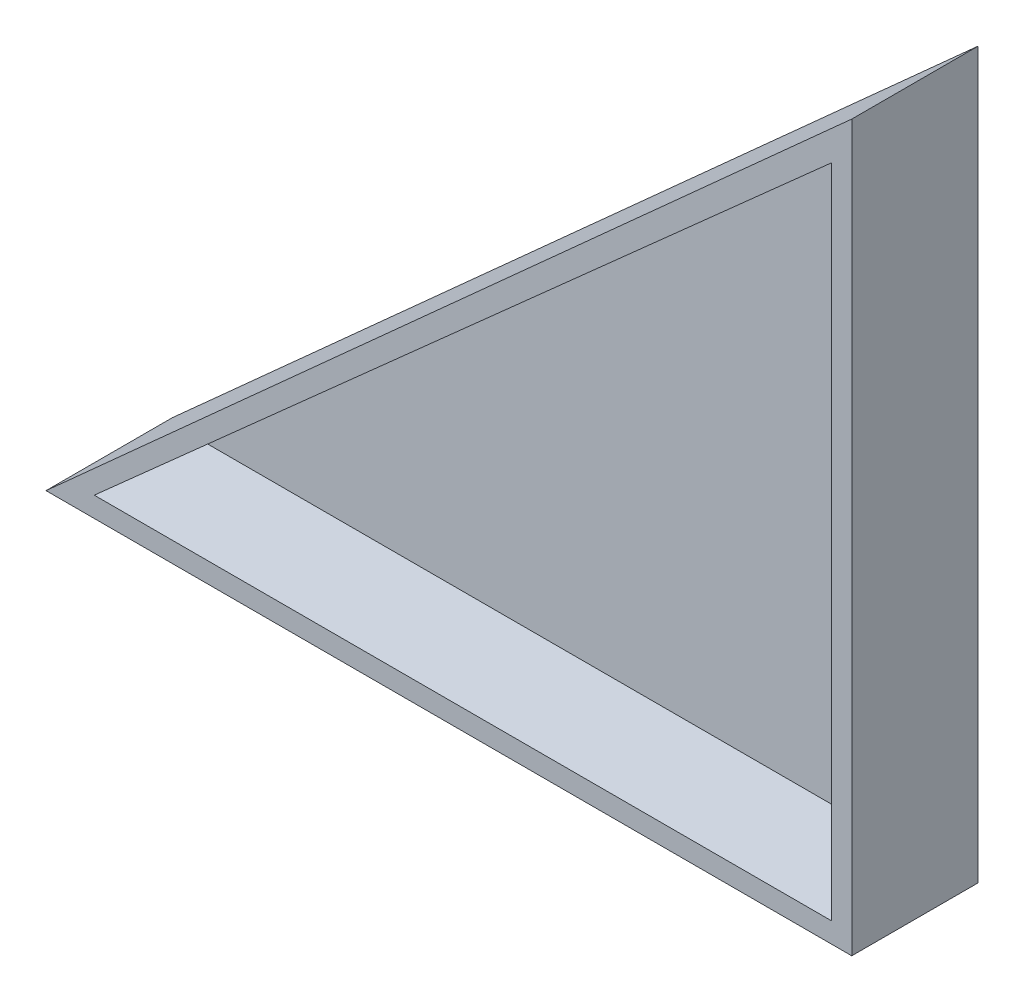
ISO-10303-21;
HEADER;
FILE_DESCRIPTION(('STEP AP214'),'2;1');
FILE_NAME('part.step','',(''),(''),'','','');
FILE_SCHEMA(('AUTOMOTIVE_DESIGN { 1 0 10303 214 1 1 1 1 }'));
ENDSEC;
DATA;
#1=APPLICATION_CONTEXT('core data for automotive mechanical design processes');
#2=APPLICATION_PROTOCOL_DEFINITION('international standard','automotive_design',2000,#1);
#3=PRODUCT_CONTEXT('',#1,'mechanical');
#4=PRODUCT('Part','Part','',(#3));
#5=PRODUCT_RELATED_PRODUCT_CATEGORY('part','',(#4));
#6=PRODUCT_DEFINITION_FORMATION('','',#4);
#7=PRODUCT_DEFINITION_CONTEXT('part definition',#1,'design');
#8=PRODUCT_DEFINITION('design','',#6,#7);
#9=PRODUCT_DEFINITION_SHAPE('','',#8);
#10=(LENGTH_UNIT() NAMED_UNIT(*) SI_UNIT(.MILLI.,.METRE.));
#11=(NAMED_UNIT(*) PLANE_ANGLE_UNIT() SI_UNIT($,.RADIAN.));
#12=(NAMED_UNIT(*) SI_UNIT($,.STERADIAN.) SOLID_ANGLE_UNIT());
#13=UNCERTAINTY_MEASURE_WITH_UNIT(LENGTH_MEASURE(1.E-05),#10,'distance_accuracy_value','');
#14=(GEOMETRIC_REPRESENTATION_CONTEXT(3) GLOBAL_UNCERTAINTY_ASSIGNED_CONTEXT((#13)) GLOBAL_UNIT_ASSIGNED_CONTEXT((#10,
#11,#12)) REPRESENTATION_CONTEXT('',''));
#15=CARTESIAN_POINT('',(0.,0.,0.));
#16=DIRECTION('',(0.,0.,1.));
#17=DIRECTION('',(1.,0.,0.));
#18=AXIS2_PLACEMENT_3D('',#15,#16,#17);
#19=CARTESIAN_POINT('',(0.,0.,1.5875));
#20=DIRECTION('',(0.,0.,-1.));
#21=DIRECTION('',(-1.,0.,0.));
#22=AXIS2_PLACEMENT_3D('',#19,#20,#21);
#23=PLANE('',#22);
#24=DIRECTION('',(0.,-1.,0.));
#25=VECTOR('',#24,1.);
#26=CARTESIAN_POINT('',(33.2174473505233,54.3486887095964,1.5875));
#27=LINE('',#26,#25);
#28=CARTESIAN_POINT('',(33.2174473505233,54.3486887095964,1.5875));
#29=VERTEX_POINT('',#28);
#30=CARTESIAN_POINT('',(33.2174473505233,13.0736887095964,1.5875));
#31=VERTEX_POINT('',#30);
#32=EDGE_CURVE('E54',#29,#31,#27,.T.);
#33=ORIENTED_EDGE('',*,*,#32,.F.);
#34=DIRECTION('',(-0.746844593870614,-0.664998610980683,0.));
#35=VECTOR('',#34,1.);
#36=CARTESIAN_POINT('',(33.2174473505233,54.3486887095964,1.5875));
#37=LINE('',#36,#35);
#38=CARTESIAN_POINT('',(-13.1375526494767,13.0736887095963,1.5875));
#39=VERTEX_POINT('',#38);
#40=EDGE_CURVE('E11',#29,#39,#37,.T.);
#41=ORIENTED_EDGE('',*,*,#40,.T.);
#42=DIRECTION('',(-1.,0.,0.));
#43=VECTOR('',#42,1.);
#44=CARTESIAN_POINT('',(33.2174473505233,13.0736887095964,1.5875));
#45=LINE('',#44,#43);
#46=EDGE_CURVE('E48',#31,#39,#45,.T.);
#47=ORIENTED_EDGE('',*,*,#46,.F.);
#48=EDGE_LOOP('',(#33,#41,#47));
#49=FACE_BOUND('',#48,.T.);
#50=ADVANCED_FACE('F39',(#49),#23,.F.);
#51=CARTESIAN_POINT('',(33.2174473505233,54.3486887095964,7.9375));
#52=DIRECTION('',(0.664998610980683,-0.746844593870614,0.));
#53=DIRECTION('',(0.746844593870614,0.664998610980683,0.));
#54=AXIS2_PLACEMENT_3D('',#51,#52,#53);
#55=PLANE('',#54);
#56=ORIENTED_EDGE('',*,*,#40,.F.);
#57=DIRECTION('',(0.,0.,-1.));
#58=VECTOR('',#57,1.);
#59=CARTESIAN_POINT('',(33.2174473505233,54.3486887095964,7.9375));
#60=LINE('',#59,#58);
#61=CARTESIAN_POINT('',(33.2174473505233,54.3486887095964,7.9375));
#62=VERTEX_POINT('',#61);
#63=EDGE_CURVE('E95',#62,#29,#60,.T.);
#64=ORIENTED_EDGE('',*,*,#63,.F.);
#65=DIRECTION('',(-0.746844593870614,-0.664998610980683,0.));
#66=VECTOR('',#65,1.);
#67=CARTESIAN_POINT('',(33.2174473505233,54.3486887095964,7.9375));
#68=LINE('',#67,#66);
#69=CARTESIAN_POINT('',(-13.1375526494767,13.0736887095963,7.9375));
#70=VERTEX_POINT('',#69);
#71=EDGE_CURVE('E90',#62,#70,#68,.T.);
#72=ORIENTED_EDGE('',*,*,#71,.T.);
#73=DIRECTION('',(0.,0.,-1.));
#74=VECTOR('',#73,1.);
#75=CARTESIAN_POINT('',(-13.1375526494767,13.0736887095963,7.9375));
#76=LINE('',#75,#74);
#77=EDGE_CURVE('E93',#70,#39,#76,.T.);
#78=ORIENTED_EDGE('',*,*,#77,.T.);
#79=EDGE_LOOP('',(#56,#64,#72,#78));
#80=FACE_BOUND('',#79,.T.);
#81=ADVANCED_FACE('F92',(#80),#55,.T.);
#82=CARTESIAN_POINT('',(33.2174473505233,13.0736887095964,7.9375));
#83=DIRECTION('',(0.,1.,0.));
#84=DIRECTION('',(-1.,0.,0.));
#85=AXIS2_PLACEMENT_3D('',#82,#83,#84);
#86=PLANE('',#85);
#87=ORIENTED_EDGE('',*,*,#46,.T.);
#88=ORIENTED_EDGE('',*,*,#77,.F.);
#89=DIRECTION('',(1.,0.,0.));
#90=VECTOR('',#89,1.);
#91=CARTESIAN_POINT('',(33.2174473505233,13.0736887095964,7.9375));
#92=LINE('',#91,#90);
#93=CARTESIAN_POINT('',(33.2174473505233,13.0736887095964,7.9375));
#94=VERTEX_POINT('',#93);
#95=EDGE_CURVE('E100',#70,#94,#92,.T.);
#96=ORIENTED_EDGE('',*,*,#95,.T.);
#97=DIRECTION('',(0.,0.,-1.));
#98=VECTOR('',#97,1.);
#99=CARTESIAN_POINT('',(33.2174473505233,13.0736887095964,7.9375));
#100=LINE('',#99,#98);
#101=EDGE_CURVE('E108',#94,#31,#100,.T.);
#102=ORIENTED_EDGE('',*,*,#101,.T.);
#103=EDGE_LOOP('',(#87,#88,#96,#102));
#104=FACE_BOUND('',#103,.T.);
#105=ADVANCED_FACE('F104',(#104),#86,.T.);
#106=CARTESIAN_POINT('',(33.2174473505233,54.3486887095964,7.9375));
#107=DIRECTION('',(-1.,0.,0.));
#108=DIRECTION('',(0.,-1.,0.));
#109=AXIS2_PLACEMENT_3D('',#106,#107,#108);
#110=PLANE('',#109);
#111=ORIENTED_EDGE('',*,*,#32,.T.);
#112=ORIENTED_EDGE('',*,*,#101,.F.);
#113=DIRECTION('',(0.,1.,0.));
#114=VECTOR('',#113,1.);
#115=CARTESIAN_POINT('',(33.2174473505233,54.3486887095964,7.9375));
#116=LINE('',#115,#114);
#117=EDGE_CURVE('E111',#94,#62,#116,.T.);
#118=ORIENTED_EDGE('',*,*,#117,.T.);
#119=ORIENTED_EDGE('',*,*,#63,.T.);
#120=EDGE_LOOP('',(#111,#112,#118,#119));
#121=FACE_BOUND('',#120,.T.);
#122=ADVANCED_FACE('F155',(#121),#110,.T.);
#123=CARTESIAN_POINT('',(0.,0.,7.9375));
#124=DIRECTION('',(0.,0.,1.));
#125=DIRECTION('',(1.,0.,0.));
#126=AXIS2_PLACEMENT_3D('',#123,#124,#125);
#127=PLANE('',#126);
#128=DIRECTION('',(-0.743529626144011,-0.66870299464422,0.));
#129=VECTOR('',#128,1.);
#130=CARTESIAN_POINT('',(34.4874473505233,57.3647466855964,7.9375));
#131=LINE('',#130,#129);
#132=CARTESIAN_POINT('',(34.4874473505233,57.3647466855964,7.9375));
#133=VERTEX_POINT('',#132);
#134=CARTESIAN_POINT('',(-16.1718089634766,11.8036887095963,7.9375));
#135=VERTEX_POINT('',#134);
#136=EDGE_CURVE('E121',#133,#135,#131,.T.);
#137=ORIENTED_EDGE('',*,*,#136,.T.);
#138=DIRECTION('',(1.,0.,0.));
#139=VECTOR('',#138,1.);
#140=CARTESIAN_POINT('',(34.4874473505234,11.8036887095964,7.9375));
#141=LINE('',#140,#139);
#142=CARTESIAN_POINT('',(34.4874473505234,11.8036887095964,7.9375));
#143=VERTEX_POINT('',#142);
#144=EDGE_CURVE('E125',#135,#143,#141,.T.);
#145=ORIENTED_EDGE('',*,*,#144,.T.);
#146=DIRECTION('',(0.,1.,0.));
#147=VECTOR('',#146,1.);
#148=CARTESIAN_POINT('',(34.4874473505233,57.3647466855964,7.9375));
#149=LINE('',#148,#147);
#150=EDGE_CURVE('E129',#143,#133,#149,.T.);
#151=ORIENTED_EDGE('',*,*,#150,.T.);
#152=EDGE_LOOP('',(#137,#145,#151));
#153=FACE_BOUND('',#152,.T.);
#154=ORIENTED_EDGE('',*,*,#95,.F.);
#155=ORIENTED_EDGE('',*,*,#71,.F.);
#156=ORIENTED_EDGE('',*,*,#117,.F.);
#157=EDGE_LOOP('',(#154,#155,#156));
#158=FACE_BOUND('',#157,.T.);
#159=ADVANCED_FACE('F110',(#153,#158),#127,.T.);
#160=CARTESIAN_POINT('',(34.4874473505233,57.3647466855964,7.9375));
#161=DIRECTION('',(0.66870299464422,-0.743529626144011,0.));
#162=DIRECTION('',(0.743529626144011,0.66870299464422,0.));
#163=AXIS2_PLACEMENT_3D('',#160,#161,#162);
#164=PLANE('',#163);
#165=DIRECTION('',(-0.743529626144011,-0.66870299464422,0.));
#166=VECTOR('',#165,1.);
#167=CARTESIAN_POINT('',(34.4874473505233,57.3647466855964,0.));
#168=LINE('',#167,#166);
#169=CARTESIAN_POINT('',(34.4874473505233,57.3647466855964,0.));
#170=VERTEX_POINT('',#169);
#171=CARTESIAN_POINT('',(-16.1718089634766,11.8036887095963,0.));
#172=VERTEX_POINT('',#171);
#173=EDGE_CURVE('E107',#170,#172,#168,.T.);
#174=ORIENTED_EDGE('',*,*,#173,.T.);
#175=DIRECTION('',(0.,0.,-1.));
#176=VECTOR('',#175,1.);
#177=CARTESIAN_POINT('',(-16.1718089634766,11.8036887095963,7.9375));
#178=LINE('',#177,#176);
#179=EDGE_CURVE('E148',#135,#172,#178,.T.);
#180=ORIENTED_EDGE('',*,*,#179,.F.);
#181=ORIENTED_EDGE('',*,*,#136,.F.);
#182=DIRECTION('',(0.,0.,-1.));
#183=VECTOR('',#182,1.);
#184=CARTESIAN_POINT('',(34.4874473505233,57.3647466855964,7.9375));
#185=LINE('',#184,#183);
#186=EDGE_CURVE('E132',#133,#170,#185,.T.);
#187=ORIENTED_EDGE('',*,*,#186,.T.);
#188=EDGE_LOOP('',(#174,#180,#181,#187));
#189=FACE_BOUND('',#188,.T.);
#190=ADVANCED_FACE('F162',(#189),#164,.F.);
#191=CARTESIAN_POINT('',(34.4874473505234,11.8036887095964,7.9375));
#192=DIRECTION('',(0.,1.,0.));
#193=DIRECTION('',(-1.,0.,0.));
#194=AXIS2_PLACEMENT_3D('',#191,#192,#193);
#195=PLANE('',#194);
#196=DIRECTION('',(1.,0.,0.));
#197=VECTOR('',#196,1.);
#198=CARTESIAN_POINT('',(34.4874473505234,11.8036887095964,0.));
#199=LINE('',#198,#197);
#200=CARTESIAN_POINT('',(34.4874473505234,11.8036887095964,0.));
#201=VERTEX_POINT('',#200);
#202=EDGE_CURVE('E136',#172,#201,#199,.T.);
#203=ORIENTED_EDGE('',*,*,#202,.T.);
#204=DIRECTION('',(0.,0.,-1.));
#205=VECTOR('',#204,1.);
#206=CARTESIAN_POINT('',(34.4874473505234,11.8036887095964,7.9375));
#207=LINE('',#206,#205);
#208=EDGE_CURVE('E144',#143,#201,#207,.T.);
#209=ORIENTED_EDGE('',*,*,#208,.F.);
#210=ORIENTED_EDGE('',*,*,#144,.F.);
#211=ORIENTED_EDGE('',*,*,#179,.T.);
#212=EDGE_LOOP('',(#203,#209,#210,#211));
#213=FACE_BOUND('',#212,.T.);
#214=ADVANCED_FACE('F174',(#213),#195,.F.);
#215=CARTESIAN_POINT('',(34.4874473505233,57.3647466855964,7.9375));
#216=DIRECTION('',(-1.,0.,0.));
#217=DIRECTION('',(0.,-1.,0.));
#218=AXIS2_PLACEMENT_3D('',#215,#216,#217);
#219=PLANE('',#218);
#220=DIRECTION('',(0.,1.,0.));
#221=VECTOR('',#220,1.);
#222=CARTESIAN_POINT('',(34.4874473505233,57.3647466855964,0.));
#223=LINE('',#222,#221);
#224=EDGE_CURVE('E126',#201,#170,#223,.T.);
#225=ORIENTED_EDGE('',*,*,#224,.T.);
#226=ORIENTED_EDGE('',*,*,#186,.F.);
#227=ORIENTED_EDGE('',*,*,#150,.F.);
#228=ORIENTED_EDGE('',*,*,#208,.T.);
#229=EDGE_LOOP('',(#225,#226,#227,#228));
#230=FACE_BOUND('',#229,.T.);
#231=ADVANCED_FACE('F178',(#230),#219,.F.);
#232=CARTESIAN_POINT('',(0.,0.,0.));
#233=DIRECTION('',(0.,0.,-1.));
#234=DIRECTION('',(-1.,0.,0.));
#235=AXIS2_PLACEMENT_3D('',#232,#233,#234);
#236=PLANE('',#235);
#237=ORIENTED_EDGE('',*,*,#173,.F.);
#238=ORIENTED_EDGE('',*,*,#224,.F.);
#239=ORIENTED_EDGE('',*,*,#202,.F.);
#240=EDGE_LOOP('',(#237,#238,#239));
#241=FACE_BOUND('',#240,.T.);
#242=ADVANCED_FACE('F41',(#241),#236,.T.);
#243=CLOSED_SHELL('',(#50,#81,#105,#122,#159,#190,#214,#231,#242));
#244=MANIFOLD_SOLID_BREP('B2',#243);
#245=ADVANCED_BREP_SHAPE_REPRESENTATION('',(#18,#244),#14);
#246=SHAPE_DEFINITION_REPRESENTATION(#9,#245);
ENDSEC;
END-ISO-10303-21;
